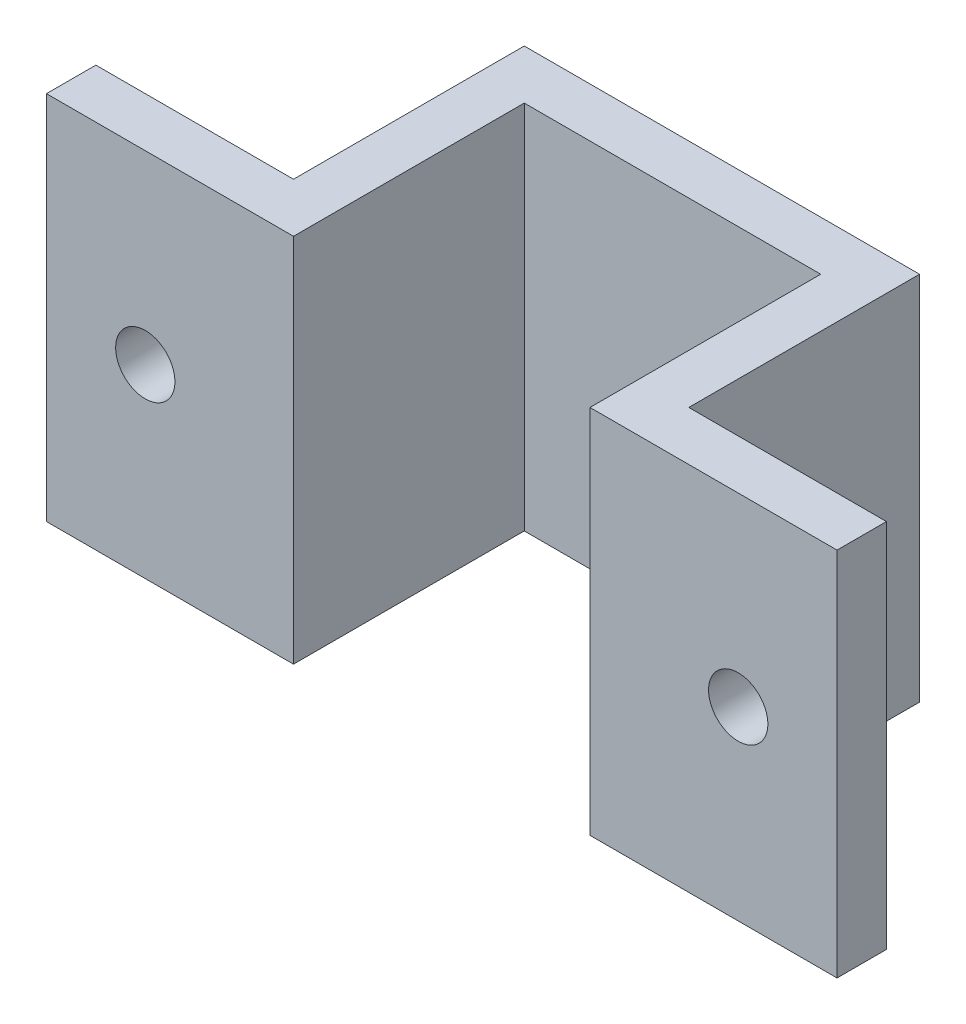
ISO-10303-21;
HEADER;
FILE_DESCRIPTION(('STEP AP214'),'2;1');
FILE_NAME('part.step','',(''),(''),'','','');
FILE_SCHEMA(('AUTOMOTIVE_DESIGN { 1 0 10303 214 1 1 1 1 }'));
ENDSEC;
DATA;
#1=APPLICATION_CONTEXT('core data for automotive mechanical design processes');
#2=APPLICATION_PROTOCOL_DEFINITION('international standard','automotive_design',2000,#1);
#3=PRODUCT_CONTEXT('',#1,'mechanical');
#4=PRODUCT('Part','Part','',(#3));
#5=PRODUCT_RELATED_PRODUCT_CATEGORY('part','',(#4));
#6=PRODUCT_DEFINITION_FORMATION('','',#4);
#7=PRODUCT_DEFINITION_CONTEXT('part definition',#1,'design');
#8=PRODUCT_DEFINITION('design','',#6,#7);
#9=PRODUCT_DEFINITION_SHAPE('','',#8);
#10=(LENGTH_UNIT() NAMED_UNIT(*) SI_UNIT(.MILLI.,.METRE.));
#11=(NAMED_UNIT(*) PLANE_ANGLE_UNIT() SI_UNIT($,.RADIAN.));
#12=(NAMED_UNIT(*) SI_UNIT($,.STERADIAN.) SOLID_ANGLE_UNIT());
#13=UNCERTAINTY_MEASURE_WITH_UNIT(LENGTH_MEASURE(1.E-05),#10,'distance_accuracy_value','');
#14=(GEOMETRIC_REPRESENTATION_CONTEXT(3) GLOBAL_UNCERTAINTY_ASSIGNED_CONTEXT((#13)) GLOBAL_UNIT_ASSIGNED_CONTEXT((#10,
#11,#12)) REPRESENTATION_CONTEXT('',''));
#15=CARTESIAN_POINT('',(0.,0.,0.));
#16=DIRECTION('',(0.,0.,1.));
#17=DIRECTION('',(1.,0.,0.));
#18=AXIS2_PLACEMENT_3D('',#15,#16,#17);
#19=CARTESIAN_POINT('',(7.62,19.05,-11.8618));
#20=DIRECTION('',(1.,0.,0.));
#21=DIRECTION('',(0.,0.,-1.));
#22=AXIS2_PLACEMENT_3D('',#19,#20,#21);
#23=PLANE('',#22);
#24=DIRECTION('',(0.,0.,1.));
#25=VECTOR('',#24,1.);
#26=CARTESIAN_POINT('',(7.62,0.,-11.8618));
#27=LINE('',#26,#25);
#28=CARTESIAN_POINT('',(7.62,0.,-11.8618));
#29=VERTEX_POINT('',#28);
#30=CARTESIAN_POINT('',(7.62,0.,0.));
#31=VERTEX_POINT('',#30);
#32=EDGE_CURVE('E152',#29,#31,#27,.T.);
#33=ORIENTED_EDGE('',*,*,#32,.T.);
#34=DIRECTION('',(0.,-1.,0.));
#35=VECTOR('',#34,1.);
#36=CARTESIAN_POINT('',(7.62,19.05,0.));
#37=LINE('',#36,#35);
#38=CARTESIAN_POINT('',(7.62,19.05,0.));
#39=VERTEX_POINT('',#38);
#40=EDGE_CURVE('E11',#39,#31,#37,.T.);
#41=ORIENTED_EDGE('',*,*,#40,.F.);
#42=DIRECTION('',(0.,0.,1.));
#43=VECTOR('',#42,1.);
#44=CARTESIAN_POINT('',(7.62,19.05,-11.8618));
#45=LINE('',#44,#43);
#46=CARTESIAN_POINT('',(7.62,19.05,-11.8618));
#47=VERTEX_POINT('',#46);
#48=EDGE_CURVE('E175',#47,#39,#45,.T.);
#49=ORIENTED_EDGE('',*,*,#48,.F.);
#50=DIRECTION('',(0.,-1.,0.));
#51=VECTOR('',#50,1.);
#52=CARTESIAN_POINT('',(7.62,19.05,-11.8618));
#53=LINE('',#52,#51);
#54=EDGE_CURVE('E148',#47,#29,#53,.T.);
#55=ORIENTED_EDGE('',*,*,#54,.T.);
#56=EDGE_LOOP('',(#33,#41,#49,#55));
#57=FACE_BOUND('',#56,.T.);
#58=ADVANCED_FACE('F32',(#57),#23,.F.);
#59=CARTESIAN_POINT('',(7.62,19.05,0.));
#60=DIRECTION('',(0.,0.,-1.));
#61=DIRECTION('',(-1.,0.,0.));
#62=AXIS2_PLACEMENT_3D('',#59,#60,#61);
#63=PLANE('',#62);
#64=CARTESIAN_POINT('',(15.24,9.525,0.));
#65=DIRECTION('',(0.,0.,-1.));
#66=DIRECTION('',(-1.,0.,0.));
#67=AXIS2_PLACEMENT_3D('',#64,#65,#66);
#68=CIRCLE('',#67,1.524);
#69=CARTESIAN_POINT('',(13.716,9.525,0.));
#70=VERTEX_POINT('',#69);
#71=EDGE_CURVE('E292',#70,#70,#68,.T.);
#72=ORIENTED_EDGE('',*,*,#71,.T.);
#73=EDGE_LOOP('',(#72));
#74=FACE_BOUND('',#73,.T.);
#75=DIRECTION('',(1.,0.,0.));
#76=VECTOR('',#75,1.);
#77=CARTESIAN_POINT('',(7.62,0.,0.));
#78=LINE('',#77,#76);
#79=CARTESIAN_POINT('',(20.32,0.,0.));
#80=VERTEX_POINT('',#79);
#81=EDGE_CURVE('E155',#31,#80,#78,.T.);
#82=ORIENTED_EDGE('',*,*,#81,.T.);
#83=DIRECTION('',(0.,-1.,0.));
#84=VECTOR('',#83,1.);
#85=CARTESIAN_POINT('',(20.32,19.05,0.));
#86=LINE('',#85,#84);
#87=CARTESIAN_POINT('',(20.32,19.05,0.));
#88=VERTEX_POINT('',#87);
#89=EDGE_CURVE('E40',#88,#80,#86,.T.);
#90=ORIENTED_EDGE('',*,*,#89,.F.);
#91=DIRECTION('',(1.,0.,0.));
#92=VECTOR('',#91,1.);
#93=CARTESIAN_POINT('',(7.62,19.05,0.));
#94=LINE('',#93,#92);
#95=EDGE_CURVE('E103',#39,#88,#94,.T.);
#96=ORIENTED_EDGE('',*,*,#95,.F.);
#97=ORIENTED_EDGE('',*,*,#40,.T.);
#98=EDGE_LOOP('',(#82,#90,#96,#97));
#99=FACE_BOUND('',#98,.T.);
#100=ADVANCED_FACE('F253',(#74,#99),#63,.F.);
#101=CARTESIAN_POINT('',(20.32,19.05,0.));
#102=DIRECTION('',(-1.,0.,0.));
#103=DIRECTION('',(0.,0.,1.));
#104=AXIS2_PLACEMENT_3D('',#101,#102,#103);
#105=PLANE('',#104);
#106=DIRECTION('',(0.,0.,-1.));
#107=VECTOR('',#106,1.);
#108=CARTESIAN_POINT('',(20.32,0.,0.));
#109=LINE('',#108,#107);
#110=CARTESIAN_POINT('',(20.32,0.,-2.54));
#111=VERTEX_POINT('',#110);
#112=EDGE_CURVE('E158',#80,#111,#109,.T.);
#113=ORIENTED_EDGE('',*,*,#112,.T.);
#114=DIRECTION('',(0.,-1.,0.));
#115=VECTOR('',#114,1.);
#116=CARTESIAN_POINT('',(20.32,19.05,-2.54));
#117=LINE('',#116,#115);
#118=CARTESIAN_POINT('',(20.32,19.05,-2.54));
#119=VERTEX_POINT('',#118);
#120=EDGE_CURVE('E194',#119,#111,#117,.T.);
#121=ORIENTED_EDGE('',*,*,#120,.F.);
#122=DIRECTION('',(0.,0.,-1.));
#123=VECTOR('',#122,1.);
#124=CARTESIAN_POINT('',(20.32,19.05,0.));
#125=LINE('',#124,#123);
#126=EDGE_CURVE('E202',#88,#119,#125,.T.);
#127=ORIENTED_EDGE('',*,*,#126,.F.);
#128=ORIENTED_EDGE('',*,*,#89,.T.);
#129=EDGE_LOOP('',(#113,#121,#127,#128));
#130=FACE_BOUND('',#129,.T.);
#131=ADVANCED_FACE('F200',(#130),#105,.F.);
#132=CARTESIAN_POINT('',(20.32,19.05,-2.54));
#133=DIRECTION('',(0.,0.,1.));
#134=DIRECTION('',(1.,0.,0.));
#135=AXIS2_PLACEMENT_3D('',#132,#133,#134);
#136=PLANE('',#135);
#137=CARTESIAN_POINT('',(15.24,9.525,-2.54));
#138=DIRECTION('',(0.,0.,-1.));
#139=DIRECTION('',(-1.,0.,0.));
#140=AXIS2_PLACEMENT_3D('',#137,#138,#139);
#141=CIRCLE('',#140,1.524);
#142=CARTESIAN_POINT('',(13.716,9.525,-2.54));
#143=VERTEX_POINT('',#142);
#144=EDGE_CURVE('E296',#143,#143,#141,.T.);
#145=ORIENTED_EDGE('',*,*,#144,.F.);
#146=EDGE_LOOP('',(#145));
#147=FACE_BOUND('',#146,.T.);
#148=DIRECTION('',(-1.,0.,0.));
#149=VECTOR('',#148,1.);
#150=CARTESIAN_POINT('',(20.32,0.,-2.54));
#151=LINE('',#150,#149);
#152=CARTESIAN_POINT('',(10.16,0.,-2.54));
#153=VERTEX_POINT('',#152);
#154=EDGE_CURVE('E160',#111,#153,#151,.T.);
#155=ORIENTED_EDGE('',*,*,#154,.T.);
#156=DIRECTION('',(0.,-1.,0.));
#157=VECTOR('',#156,1.);
#158=CARTESIAN_POINT('',(10.16,19.05,-2.54));
#159=LINE('',#158,#157);
#160=CARTESIAN_POINT('',(10.16,19.05,-2.54));
#161=VERTEX_POINT('',#160);
#162=EDGE_CURVE('E191',#161,#153,#159,.T.);
#163=ORIENTED_EDGE('',*,*,#162,.F.);
#164=DIRECTION('',(-1.,0.,0.));
#165=VECTOR('',#164,1.);
#166=CARTESIAN_POINT('',(20.32,19.05,-2.54));
#167=LINE('',#166,#165);
#168=EDGE_CURVE('E220',#119,#161,#167,.T.);
#169=ORIENTED_EDGE('',*,*,#168,.F.);
#170=ORIENTED_EDGE('',*,*,#120,.T.);
#171=EDGE_LOOP('',(#155,#163,#169,#170));
#172=FACE_BOUND('',#171,.T.);
#173=ADVANCED_FACE('F211',(#147,#172),#136,.F.);
#174=CARTESIAN_POINT('',(10.16,19.05,-2.54));
#175=DIRECTION('',(-1.,0.,0.));
#176=DIRECTION('',(0.,0.,1.));
#177=AXIS2_PLACEMENT_3D('',#174,#175,#176);
#178=PLANE('',#177);
#179=DIRECTION('',(0.,0.,-1.));
#180=VECTOR('',#179,1.);
#181=CARTESIAN_POINT('',(10.16,0.,-2.54));
#182=LINE('',#181,#180);
#183=CARTESIAN_POINT('',(10.16,0.,-14.4018));
#184=VERTEX_POINT('',#183);
#185=EDGE_CURVE('E162',#153,#184,#182,.T.);
#186=ORIENTED_EDGE('',*,*,#185,.T.);
#187=DIRECTION('',(0.,-1.,0.));
#188=VECTOR('',#187,1.);
#189=CARTESIAN_POINT('',(10.16,19.05,-14.4018));
#190=LINE('',#189,#188);
#191=CARTESIAN_POINT('',(10.16,19.05,-14.4018));
#192=VERTEX_POINT('',#191);
#193=EDGE_CURVE('E188',#192,#184,#190,.T.);
#194=ORIENTED_EDGE('',*,*,#193,.F.);
#195=DIRECTION('',(0.,0.,-1.));
#196=VECTOR('',#195,1.);
#197=CARTESIAN_POINT('',(10.16,19.05,-2.54));
#198=LINE('',#197,#196);
#199=EDGE_CURVE('E217',#161,#192,#198,.T.);
#200=ORIENTED_EDGE('',*,*,#199,.F.);
#201=ORIENTED_EDGE('',*,*,#162,.T.);
#202=EDGE_LOOP('',(#186,#194,#200,#201));
#203=FACE_BOUND('',#202,.T.);
#204=ADVANCED_FACE('F215',(#203),#178,.F.);
#205=CARTESIAN_POINT('',(10.16,19.05,-14.4018));
#206=DIRECTION('',(0.,0.,1.));
#207=DIRECTION('',(1.,0.,0.));
#208=AXIS2_PLACEMENT_3D('',#205,#206,#207);
#209=PLANE('',#208);
#210=DIRECTION('',(-1.,0.,0.));
#211=VECTOR('',#210,1.);
#212=CARTESIAN_POINT('',(10.16,0.,-14.4018));
#213=LINE('',#212,#211);
#214=CARTESIAN_POINT('',(-10.16,0.,-14.4018));
#215=VERTEX_POINT('',#214);
#216=EDGE_CURVE('E164',#184,#215,#213,.T.);
#217=ORIENTED_EDGE('',*,*,#216,.T.);
#218=DIRECTION('',(0.,-1.,0.));
#219=VECTOR('',#218,1.);
#220=CARTESIAN_POINT('',(-10.16,19.05,-14.4018));
#221=LINE('',#220,#219);
#222=CARTESIAN_POINT('',(-10.16,19.05,-14.4018));
#223=VERTEX_POINT('',#222);
#224=EDGE_CURVE('E185',#223,#215,#221,.T.);
#225=ORIENTED_EDGE('',*,*,#224,.F.);
#226=DIRECTION('',(-1.,0.,0.));
#227=VECTOR('',#226,1.);
#228=CARTESIAN_POINT('',(10.16,19.05,-14.4018));
#229=LINE('',#228,#227);
#230=EDGE_CURVE('E219',#192,#223,#229,.T.);
#231=ORIENTED_EDGE('',*,*,#230,.F.);
#232=ORIENTED_EDGE('',*,*,#193,.T.);
#233=EDGE_LOOP('',(#217,#225,#231,#232));
#234=FACE_BOUND('',#233,.T.);
#235=ADVANCED_FACE('F269',(#234),#209,.F.);
#236=CARTESIAN_POINT('',(-10.16,19.05,-14.4018));
#237=DIRECTION('',(1.,0.,0.));
#238=DIRECTION('',(0.,0.,-1.));
#239=AXIS2_PLACEMENT_3D('',#236,#237,#238);
#240=PLANE('',#239);
#241=DIRECTION('',(0.,0.,1.));
#242=VECTOR('',#241,1.);
#243=CARTESIAN_POINT('',(-10.16,0.,-14.4018));
#244=LINE('',#243,#242);
#245=CARTESIAN_POINT('',(-10.16,0.,-2.54));
#246=VERTEX_POINT('',#245);
#247=EDGE_CURVE('E166',#215,#246,#244,.T.);
#248=ORIENTED_EDGE('',*,*,#247,.T.);
#249=DIRECTION('',(0.,-1.,0.));
#250=VECTOR('',#249,1.);
#251=CARTESIAN_POINT('',(-10.16,19.05,-2.54));
#252=LINE('',#251,#250);
#253=CARTESIAN_POINT('',(-10.16,19.05,-2.54));
#254=VERTEX_POINT('',#253);
#255=EDGE_CURVE('E182',#254,#246,#252,.T.);
#256=ORIENTED_EDGE('',*,*,#255,.F.);
#257=DIRECTION('',(0.,0.,1.));
#258=VECTOR('',#257,1.);
#259=CARTESIAN_POINT('',(-10.16,19.05,-14.4018));
#260=LINE('',#259,#258);
#261=EDGE_CURVE('E222',#223,#254,#260,.T.);
#262=ORIENTED_EDGE('',*,*,#261,.F.);
#263=ORIENTED_EDGE('',*,*,#224,.T.);
#264=EDGE_LOOP('',(#248,#256,#262,#263));
#265=FACE_BOUND('',#264,.T.);
#266=ADVANCED_FACE('F272',(#265),#240,.F.);
#267=CARTESIAN_POINT('',(-10.16,19.05,-2.54));
#268=DIRECTION('',(0.,0.,1.));
#269=DIRECTION('',(1.,0.,0.));
#270=AXIS2_PLACEMENT_3D('',#267,#268,#269);
#271=PLANE('',#270);
#272=CARTESIAN_POINT('',(-15.24,9.525,-2.54));
#273=DIRECTION('',(0.,0.,-1.));
#274=DIRECTION('',(-1.,0.,0.));
#275=AXIS2_PLACEMENT_3D('',#272,#273,#274);
#276=CIRCLE('',#275,1.524);
#277=CARTESIAN_POINT('',(-16.764,9.525,-2.54));
#278=VERTEX_POINT('',#277);
#279=EDGE_CURVE('E289',#278,#278,#276,.T.);
#280=ORIENTED_EDGE('',*,*,#279,.F.);
#281=EDGE_LOOP('',(#280));
#282=FACE_BOUND('',#281,.T.);
#283=DIRECTION('',(-1.,0.,0.));
#284=VECTOR('',#283,1.);
#285=CARTESIAN_POINT('',(-10.16,0.,-2.54));
#286=LINE('',#285,#284);
#287=CARTESIAN_POINT('',(-20.32,0.,-2.54));
#288=VERTEX_POINT('',#287);
#289=EDGE_CURVE('E168',#246,#288,#286,.T.);
#290=ORIENTED_EDGE('',*,*,#289,.T.);
#291=DIRECTION('',(0.,-1.,0.));
#292=VECTOR('',#291,1.);
#293=CARTESIAN_POINT('',(-20.32,19.05,-2.54));
#294=LINE('',#293,#292);
#295=CARTESIAN_POINT('',(-20.32,19.05,-2.54));
#296=VERTEX_POINT('',#295);
#297=EDGE_CURVE('E179',#296,#288,#294,.T.);
#298=ORIENTED_EDGE('',*,*,#297,.F.);
#299=DIRECTION('',(-1.,0.,0.));
#300=VECTOR('',#299,1.);
#301=CARTESIAN_POINT('',(-10.16,19.05,-2.54));
#302=LINE('',#301,#300);
#303=EDGE_CURVE('E228',#254,#296,#302,.T.);
#304=ORIENTED_EDGE('',*,*,#303,.F.);
#305=ORIENTED_EDGE('',*,*,#255,.T.);
#306=EDGE_LOOP('',(#290,#298,#304,#305));
#307=FACE_BOUND('',#306,.T.);
#308=ADVANCED_FACE('F234',(#282,#307),#271,.F.);
#309=CARTESIAN_POINT('',(-20.32,19.05,-2.54));
#310=DIRECTION('',(1.,0.,0.));
#311=DIRECTION('',(0.,0.,-1.));
#312=AXIS2_PLACEMENT_3D('',#309,#310,#311);
#313=PLANE('',#312);
#314=DIRECTION('',(0.,0.,1.));
#315=VECTOR('',#314,1.);
#316=CARTESIAN_POINT('',(-20.32,0.,-2.54));
#317=LINE('',#316,#315);
#318=CARTESIAN_POINT('',(-20.32,0.,0.));
#319=VERTEX_POINT('',#318);
#320=EDGE_CURVE('E170',#288,#319,#317,.T.);
#321=ORIENTED_EDGE('',*,*,#320,.T.);
#322=DIRECTION('',(0.,-1.,0.));
#323=VECTOR('',#322,1.);
#324=CARTESIAN_POINT('',(-20.32,19.05,0.));
#325=LINE('',#324,#323);
#326=CARTESIAN_POINT('',(-20.32,19.05,0.));
#327=VERTEX_POINT('',#326);
#328=EDGE_CURVE('E143',#327,#319,#325,.T.);
#329=ORIENTED_EDGE('',*,*,#328,.F.);
#330=DIRECTION('',(0.,0.,1.));
#331=VECTOR('',#330,1.);
#332=CARTESIAN_POINT('',(-20.32,19.05,-2.54));
#333=LINE('',#332,#331);
#334=EDGE_CURVE('E134',#296,#327,#333,.T.);
#335=ORIENTED_EDGE('',*,*,#334,.F.);
#336=ORIENTED_EDGE('',*,*,#297,.T.);
#337=EDGE_LOOP('',(#321,#329,#335,#336));
#338=FACE_BOUND('',#337,.T.);
#339=ADVANCED_FACE('F238',(#338),#313,.F.);
#340=CARTESIAN_POINT('',(-20.32,19.05,0.));
#341=DIRECTION('',(0.,0.,-1.));
#342=DIRECTION('',(-1.,0.,0.));
#343=AXIS2_PLACEMENT_3D('',#340,#341,#342);
#344=PLANE('',#343);
#345=CARTESIAN_POINT('',(-15.24,9.525,0.));
#346=DIRECTION('',(0.,0.,-1.));
#347=DIRECTION('',(-1.,0.,0.));
#348=AXIS2_PLACEMENT_3D('',#345,#346,#347);
#349=CIRCLE('',#348,1.524);
#350=CARTESIAN_POINT('',(-16.764,9.525,0.));
#351=VERTEX_POINT('',#350);
#352=EDGE_CURVE('E156',#351,#351,#349,.T.);
#353=ORIENTED_EDGE('',*,*,#352,.T.);
#354=EDGE_LOOP('',(#353));
#355=FACE_BOUND('',#354,.T.);
#356=DIRECTION('',(1.,0.,0.));
#357=VECTOR('',#356,1.);
#358=CARTESIAN_POINT('',(-20.32,0.,0.));
#359=LINE('',#358,#357);
#360=CARTESIAN_POINT('',(-7.62,0.,0.));
#361=VERTEX_POINT('',#360);
#362=EDGE_CURVE('E142',#319,#361,#359,.T.);
#363=ORIENTED_EDGE('',*,*,#362,.T.);
#364=DIRECTION('',(0.,-1.,0.));
#365=VECTOR('',#364,1.);
#366=CARTESIAN_POINT('',(-7.62,19.05,0.));
#367=LINE('',#366,#365);
#368=CARTESIAN_POINT('',(-7.62,19.05,0.));
#369=VERTEX_POINT('',#368);
#370=EDGE_CURVE('E139',#369,#361,#367,.T.);
#371=ORIENTED_EDGE('',*,*,#370,.F.);
#372=DIRECTION('',(1.,0.,0.));
#373=VECTOR('',#372,1.);
#374=CARTESIAN_POINT('',(-20.32,19.05,0.));
#375=LINE('',#374,#373);
#376=EDGE_CURVE('E128',#327,#369,#375,.T.);
#377=ORIENTED_EDGE('',*,*,#376,.F.);
#378=ORIENTED_EDGE('',*,*,#328,.T.);
#379=EDGE_LOOP('',(#363,#371,#377,#378));
#380=FACE_BOUND('',#379,.T.);
#381=ADVANCED_FACE('F140',(#355,#380),#344,.F.);
#382=CARTESIAN_POINT('',(-7.62,19.05,0.));
#383=DIRECTION('',(-1.,0.,0.));
#384=DIRECTION('',(0.,0.,1.));
#385=AXIS2_PLACEMENT_3D('',#382,#383,#384);
#386=PLANE('',#385);
#387=DIRECTION('',(0.,0.,-1.));
#388=VECTOR('',#387,1.);
#389=CARTESIAN_POINT('',(-7.62,0.,0.));
#390=LINE('',#389,#388);
#391=CARTESIAN_POINT('',(-7.62,0.,-11.8618));
#392=VERTEX_POINT('',#391);
#393=EDGE_CURVE('E89',#361,#392,#390,.T.);
#394=ORIENTED_EDGE('',*,*,#393,.T.);
#395=DIRECTION('',(0.,-1.,0.));
#396=VECTOR('',#395,1.);
#397=CARTESIAN_POINT('',(-7.62,19.05,-11.8618));
#398=LINE('',#397,#396);
#399=CARTESIAN_POINT('',(-7.62,19.05,-11.8618));
#400=VERTEX_POINT('',#399);
#401=EDGE_CURVE('E144',#400,#392,#398,.T.);
#402=ORIENTED_EDGE('',*,*,#401,.F.);
#403=DIRECTION('',(0.,0.,-1.));
#404=VECTOR('',#403,1.);
#405=CARTESIAN_POINT('',(-7.62,19.05,0.));
#406=LINE('',#405,#404);
#407=EDGE_CURVE('E132',#369,#400,#406,.T.);
#408=ORIENTED_EDGE('',*,*,#407,.F.);
#409=ORIENTED_EDGE('',*,*,#370,.T.);
#410=EDGE_LOOP('',(#394,#402,#408,#409));
#411=FACE_BOUND('',#410,.T.);
#412=ADVANCED_FACE('F146',(#411),#386,.F.);
#413=CARTESIAN_POINT('',(-7.62,19.05,-11.8618));
#414=DIRECTION('',(0.,0.,-1.));
#415=DIRECTION('',(-1.,0.,0.));
#416=AXIS2_PLACEMENT_3D('',#413,#414,#415);
#417=PLANE('',#416);
#418=DIRECTION('',(1.,0.,0.));
#419=VECTOR('',#418,1.);
#420=CARTESIAN_POINT('',(-7.62,0.,-11.8618));
#421=LINE('',#420,#419);
#422=EDGE_CURVE('E95',#392,#29,#421,.T.);
#423=ORIENTED_EDGE('',*,*,#422,.T.);
#424=ORIENTED_EDGE('',*,*,#54,.F.);
#425=DIRECTION('',(1.,0.,0.));
#426=VECTOR('',#425,1.);
#427=CARTESIAN_POINT('',(-7.62,19.05,-11.8618));
#428=LINE('',#427,#426);
#429=EDGE_CURVE('E48',#400,#47,#428,.T.);
#430=ORIENTED_EDGE('',*,*,#429,.F.);
#431=ORIENTED_EDGE('',*,*,#401,.T.);
#432=EDGE_LOOP('',(#423,#424,#430,#431));
#433=FACE_BOUND('',#432,.T.);
#434=ADVANCED_FACE('F242',(#433),#417,.F.);
#435=CARTESIAN_POINT('',(0.,19.05,0.));
#436=DIRECTION('',(0.,1.,0.));
#437=DIRECTION('',(0.,0.,1.));
#438=AXIS2_PLACEMENT_3D('',#435,#436,#437);
#439=PLANE('',#438);
#440=ORIENTED_EDGE('',*,*,#48,.T.);
#441=ORIENTED_EDGE('',*,*,#95,.T.);
#442=ORIENTED_EDGE('',*,*,#126,.T.);
#443=ORIENTED_EDGE('',*,*,#168,.T.);
#444=ORIENTED_EDGE('',*,*,#199,.T.);
#445=ORIENTED_EDGE('',*,*,#230,.T.);
#446=ORIENTED_EDGE('',*,*,#261,.T.);
#447=ORIENTED_EDGE('',*,*,#303,.T.);
#448=ORIENTED_EDGE('',*,*,#334,.T.);
#449=ORIENTED_EDGE('',*,*,#376,.T.);
#450=ORIENTED_EDGE('',*,*,#407,.T.);
#451=ORIENTED_EDGE('',*,*,#429,.T.);
#452=EDGE_LOOP('',(#440,#441,#442,#443,#444,#445,#446,#447,#448,#449,#450,#451));
#453=FACE_BOUND('',#452,.T.);
#454=ADVANCED_FACE('F130',(#453),#439,.T.);
#455=CARTESIAN_POINT('',(0.,0.,0.));
#456=DIRECTION('',(0.,1.,0.));
#457=DIRECTION('',(0.,0.,1.));
#458=AXIS2_PLACEMENT_3D('',#455,#456,#457);
#459=PLANE('',#458);
#460=ORIENTED_EDGE('',*,*,#32,.F.);
#461=ORIENTED_EDGE('',*,*,#422,.F.);
#462=ORIENTED_EDGE('',*,*,#393,.F.);
#463=ORIENTED_EDGE('',*,*,#362,.F.);
#464=ORIENTED_EDGE('',*,*,#320,.F.);
#465=ORIENTED_EDGE('',*,*,#289,.F.);
#466=ORIENTED_EDGE('',*,*,#247,.F.);
#467=ORIENTED_EDGE('',*,*,#216,.F.);
#468=ORIENTED_EDGE('',*,*,#185,.F.);
#469=ORIENTED_EDGE('',*,*,#154,.F.);
#470=ORIENTED_EDGE('',*,*,#112,.F.);
#471=ORIENTED_EDGE('',*,*,#81,.F.);
#472=EDGE_LOOP('',(#460,#461,#462,#463,#464,#465,#466,#467,#468,#469,#470,#471));
#473=FACE_BOUND('',#472,.T.);
#474=ADVANCED_FACE('F206',(#473),#459,.F.);
#475=CARTESIAN_POINT('',(-15.24,9.525,0.));
#476=DIRECTION('',(0.,0.,-1.));
#477=DIRECTION('',(-1.,0.,0.));
#478=AXIS2_PLACEMENT_3D('',#475,#476,#477);
#479=CYLINDRICAL_SURFACE('',#478,1.524);
#480=ORIENTED_EDGE('',*,*,#352,.F.);
#481=EDGE_LOOP('',(#480));
#482=FACE_BOUND('',#481,.T.);
#483=ORIENTED_EDGE('',*,*,#279,.T.);
#484=EDGE_LOOP('',(#483));
#485=FACE_BOUND('',#484,.T.);
#486=ADVANCED_FACE('F304',(#482,#485),#479,.F.);
#487=CARTESIAN_POINT('',(15.24,9.525,0.));
#488=DIRECTION('',(0.,0.,-1.));
#489=DIRECTION('',(-1.,0.,0.));
#490=AXIS2_PLACEMENT_3D('',#487,#488,#489);
#491=CYLINDRICAL_SURFACE('',#490,1.524);
#492=ORIENTED_EDGE('',*,*,#71,.F.);
#493=EDGE_LOOP('',(#492));
#494=FACE_BOUND('',#493,.T.);
#495=ORIENTED_EDGE('',*,*,#144,.T.);
#496=EDGE_LOOP('',(#495));
#497=FACE_BOUND('',#496,.T.);
#498=ADVANCED_FACE('F302',(#494,#497),#491,.F.);
#499=CLOSED_SHELL('',(#58,#100,#131,#173,#204,#235,#266,#308,#339,#381,#412,#434,#454,#474,#486,#498));
#500=MANIFOLD_SOLID_BREP('B2',#499);
#501=ADVANCED_BREP_SHAPE_REPRESENTATION('',(#18,#500),#14);
#502=SHAPE_DEFINITION_REPRESENTATION(#9,#501);
ENDSEC;
END-ISO-10303-21;
